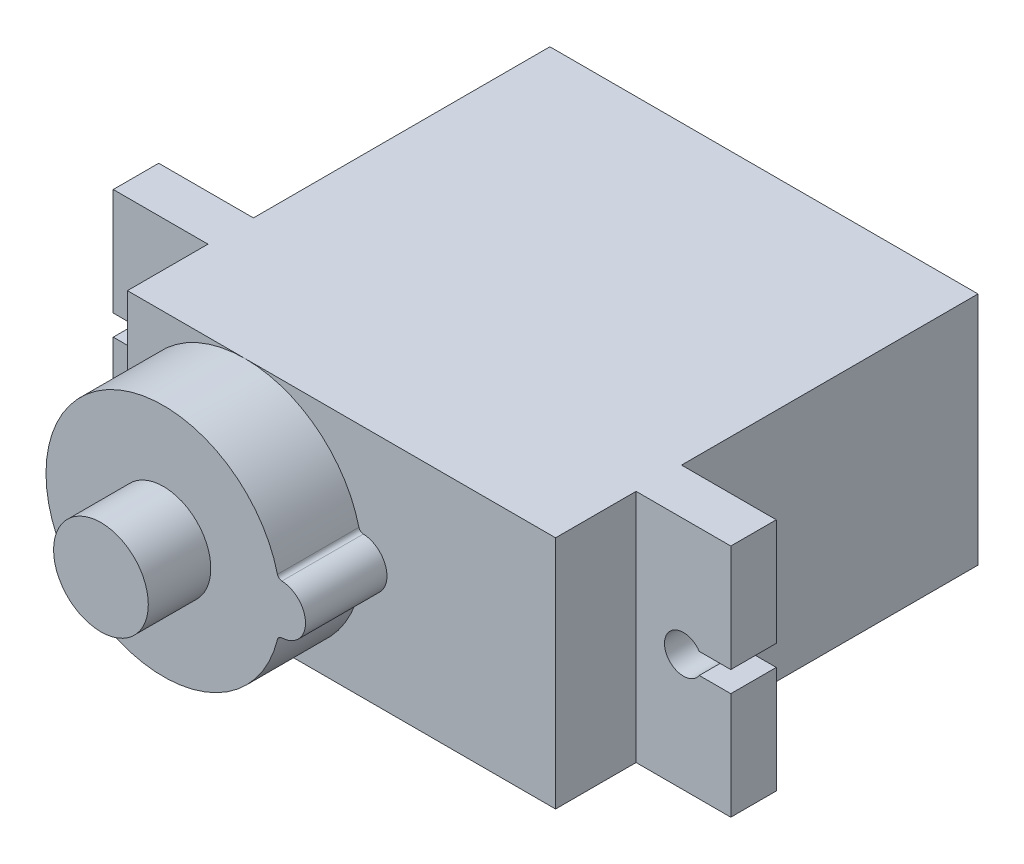
ISO-10303-21;
HEADER;
FILE_DESCRIPTION(('STEP AP214'),'2;1');
FILE_NAME('part.step','',(''),(''),'','','');
FILE_SCHEMA(('AUTOMOTIVE_DESIGN { 1 0 10303 214 1 1 1 1 }'));
ENDSEC;
DATA;
#1=APPLICATION_CONTEXT('core data for automotive mechanical design processes');
#2=APPLICATION_PROTOCOL_DEFINITION('international standard','automotive_design',2000,#1);
#3=PRODUCT_CONTEXT('',#1,'mechanical');
#4=PRODUCT('Part','Part','',(#3));
#5=PRODUCT_RELATED_PRODUCT_CATEGORY('part','',(#4));
#6=PRODUCT_DEFINITION_FORMATION('','',#4);
#7=PRODUCT_DEFINITION_CONTEXT('part definition',#1,'design');
#8=PRODUCT_DEFINITION('design','',#6,#7);
#9=PRODUCT_DEFINITION_SHAPE('','',#8);
#10=(LENGTH_UNIT() NAMED_UNIT(*) SI_UNIT(.MILLI.,.METRE.));
#11=(NAMED_UNIT(*) PLANE_ANGLE_UNIT() SI_UNIT($,.RADIAN.));
#12=(NAMED_UNIT(*) SI_UNIT($,.STERADIAN.) SOLID_ANGLE_UNIT());
#13=UNCERTAINTY_MEASURE_WITH_UNIT(LENGTH_MEASURE(1.E-05),#10,'distance_accuracy_value','');
#14=(GEOMETRIC_REPRESENTATION_CONTEXT(3) GLOBAL_UNCERTAINTY_ASSIGNED_CONTEXT((#13)) GLOBAL_UNIT_ASSIGNED_CONTEXT((#10,
#11,#12)) REPRESENTATION_CONTEXT('',''));
#15=CARTESIAN_POINT('',(0.,0.,0.));
#16=DIRECTION('',(0.,0.,1.));
#17=DIRECTION('',(1.,0.,0.));
#18=AXIS2_PLACEMENT_3D('',#15,#16,#17);
#19=CARTESIAN_POINT('',(-14.6,-1.2,4.5));
#20=DIRECTION('',(1.,0.,0.));
#21=DIRECTION('',(0.,1.,0.));
#22=AXIS2_PLACEMENT_3D('',#19,#20,#21);
#23=CYLINDRICAL_SURFACE('',#22,0.6);
#24=CARTESIAN_POINT('',(-14.6,-1.2,4.5));
#25=DIRECTION('',(-1.,0.,0.));
#26=DIRECTION('',(0.,-1.,0.));
#27=AXIS2_PLACEMENT_3D('',#24,#25,#26);
#28=CIRCLE('',#27,0.6);
#29=CARTESIAN_POINT('',(-14.6,-1.8,4.5));
#30=VERTEX_POINT('',#29);
#31=EDGE_CURVE('E12',#30,#30,#28,.T.);
#32=ORIENTED_EDGE('',*,*,#31,.F.);
#33=EDGE_LOOP('',(#32));
#34=FACE_BOUND('',#33,.T.);
#35=CARTESIAN_POINT('',(-11.3,-1.2,4.5));
#36=DIRECTION('',(-1.,0.,0.));
#37=DIRECTION('',(0.,-1.,0.));
#38=AXIS2_PLACEMENT_3D('',#35,#36,#37);
#39=CIRCLE('',#38,0.6);
#40=CARTESIAN_POINT('',(-11.3,-1.8,4.5));
#41=VERTEX_POINT('',#40);
#42=EDGE_CURVE('E68',#41,#41,#39,.T.);
#43=ORIENTED_EDGE('',*,*,#42,.T.);
#44=EDGE_LOOP('',(#43));
#45=FACE_BOUND('',#44,.T.);
#46=ADVANCED_FACE('F65',(#34,#45),#23,.T.);
#47=CARTESIAN_POINT('',(-14.6,0.,0.));
#48=DIRECTION('',(-1.,0.,0.));
#49=DIRECTION('',(0.,-1.,0.));
#50=AXIS2_PLACEMENT_3D('',#47,#48,#49);
#51=PLANE('',#50);
#52=ORIENTED_EDGE('',*,*,#31,.T.);
#53=EDGE_LOOP('',(#52));
#54=FACE_BOUND('',#53,.T.);
#55=ADVANCED_FACE('F80',(#54),#51,.T.);
#56=CARTESIAN_POINT('',(-11.3,0.,0.));
#57=DIRECTION('',(-1.,0.,0.));
#58=DIRECTION('',(0.,-1.,0.));
#59=AXIS2_PLACEMENT_3D('',#56,#57,#58);
#60=PLANE('',#59);
#61=ORIENTED_EDGE('',*,*,#42,.F.);
#62=EDGE_LOOP('',(#61));
#63=FACE_BOUND('',#62,.T.);
#64=ADVANCED_FACE('F78',(#63),#60,.F.);
#65=CLOSED_SHELL('',(#46,#55,#64));
#66=MANIFOLD_SOLID_BREP('B2',#65);
#67=CARTESIAN_POINT('',(-14.6,0.,4.5));
#68=DIRECTION('',(1.,0.,0.));
#69=DIRECTION('',(0.,1.,0.));
#70=AXIS2_PLACEMENT_3D('',#67,#68,#69);
#71=CYLINDRICAL_SURFACE('',#70,0.6);
#72=CARTESIAN_POINT('',(-14.6,0.,4.5));
#73=DIRECTION('',(-1.,0.,0.));
#74=DIRECTION('',(0.,-1.,0.));
#75=AXIS2_PLACEMENT_3D('',#72,#73,#74);
#76=CIRCLE('',#75,0.6);
#77=CARTESIAN_POINT('',(-14.6,-0.600000000000002,4.5));
#78=VERTEX_POINT('',#77);
#79=EDGE_CURVE('E64',#78,#78,#76,.T.);
#80=ORIENTED_EDGE('',*,*,#79,.F.);
#81=EDGE_LOOP('',(#80));
#82=FACE_BOUND('',#81,.T.);
#83=CARTESIAN_POINT('',(-11.3,0.,4.5));
#84=DIRECTION('',(-1.,0.,0.));
#85=DIRECTION('',(0.,-1.,0.));
#86=AXIS2_PLACEMENT_3D('',#83,#84,#85);
#87=CIRCLE('',#86,0.6);
#88=CARTESIAN_POINT('',(-11.3,-0.600000000000002,4.5));
#89=VERTEX_POINT('',#88);
#90=EDGE_CURVE('E126',#89,#89,#87,.T.);
#91=ORIENTED_EDGE('',*,*,#90,.T.);
#92=EDGE_LOOP('',(#91));
#93=FACE_BOUND('',#92,.T.);
#94=ADVANCED_FACE('F123',(#82,#93),#71,.T.);
#95=CARTESIAN_POINT('',(-14.6,0.,0.));
#96=DIRECTION('',(-1.,0.,0.));
#97=DIRECTION('',(0.,-1.,0.));
#98=AXIS2_PLACEMENT_3D('',#95,#96,#97);
#99=PLANE('',#98);
#100=ORIENTED_EDGE('',*,*,#79,.T.);
#101=EDGE_LOOP('',(#100));
#102=FACE_BOUND('',#101,.T.);
#103=ADVANCED_FACE('F138',(#102),#99,.T.);
#104=CARTESIAN_POINT('',(-11.3,0.,0.));
#105=DIRECTION('',(-1.,0.,0.));
#106=DIRECTION('',(0.,-1.,0.));
#107=AXIS2_PLACEMENT_3D('',#104,#105,#106);
#108=PLANE('',#107);
#109=ORIENTED_EDGE('',*,*,#90,.F.);
#110=EDGE_LOOP('',(#109));
#111=FACE_BOUND('',#110,.T.);
#112=ADVANCED_FACE('F136',(#111),#108,.F.);
#113=CLOSED_SHELL('',(#94,#103,#112));
#114=MANIFOLD_SOLID_BREP('B7',#113);
#115=CARTESIAN_POINT('',(-14.6,1.2,4.5));
#116=DIRECTION('',(1.,0.,0.));
#117=DIRECTION('',(0.,1.,0.));
#118=AXIS2_PLACEMENT_3D('',#115,#116,#117);
#119=CYLINDRICAL_SURFACE('',#118,0.6);
#120=CARTESIAN_POINT('',(-14.6,1.2,4.5));
#121=DIRECTION('',(-1.,0.,0.));
#122=DIRECTION('',(0.,-1.,0.));
#123=AXIS2_PLACEMENT_3D('',#120,#121,#122);
#124=CIRCLE('',#123,0.6);
#125=CARTESIAN_POINT('',(-14.6,0.599999999999998,4.5));
#126=VERTEX_POINT('',#125);
#127=EDGE_CURVE('E122',#126,#126,#124,.T.);
#128=ORIENTED_EDGE('',*,*,#127,.F.);
#129=EDGE_LOOP('',(#128));
#130=FACE_BOUND('',#129,.T.);
#131=CARTESIAN_POINT('',(-11.3,1.2,4.5));
#132=DIRECTION('',(-1.,0.,0.));
#133=DIRECTION('',(0.,-1.,0.));
#134=AXIS2_PLACEMENT_3D('',#131,#132,#133);
#135=CIRCLE('',#134,0.6);
#136=CARTESIAN_POINT('',(-11.3,0.599999999999998,4.5));
#137=VERTEX_POINT('',#136);
#138=EDGE_CURVE('E185',#137,#137,#135,.T.);
#139=ORIENTED_EDGE('',*,*,#138,.T.);
#140=EDGE_LOOP('',(#139));
#141=FACE_BOUND('',#140,.T.);
#142=ADVANCED_FACE('F182',(#130,#141),#119,.T.);
#143=CARTESIAN_POINT('',(-14.6,0.,0.));
#144=DIRECTION('',(-1.,0.,0.));
#145=DIRECTION('',(0.,-1.,0.));
#146=AXIS2_PLACEMENT_3D('',#143,#144,#145);
#147=PLANE('',#146);
#148=ORIENTED_EDGE('',*,*,#127,.T.);
#149=EDGE_LOOP('',(#148));
#150=FACE_BOUND('',#149,.T.);
#151=ADVANCED_FACE('F197',(#150),#147,.T.);
#152=CARTESIAN_POINT('',(-11.3,0.,0.));
#153=DIRECTION('',(-1.,0.,0.));
#154=DIRECTION('',(0.,-1.,0.));
#155=AXIS2_PLACEMENT_3D('',#152,#153,#154);
#156=PLANE('',#155);
#157=ORIENTED_EDGE('',*,*,#138,.F.);
#158=EDGE_LOOP('',(#157));
#159=FACE_BOUND('',#158,.T.);
#160=ADVANCED_FACE('F195',(#159),#156,.F.);
#161=CLOSED_SHELL('',(#142,#151,#160));
#162=MANIFOLD_SOLID_BREP('B59',#161);
#163=CARTESIAN_POINT('',(0.,0.,22.3));
#164=DIRECTION('',(0.,0.,1.));
#165=DIRECTION('',(1.,0.,0.));
#166=AXIS2_PLACEMENT_3D('',#163,#164,#165);
#167=PLANE('',#166);
#168=CARTESIAN_POINT('',(-5.1,0.,22.3));
#169=DIRECTION('',(0.,0.,1.));
#170=DIRECTION('',(1.,0.,0.));
#171=AXIS2_PLACEMENT_3D('',#168,#169,#170);
#172=CIRCLE('',#171,6.2);
#173=CARTESIAN_POINT('',(-5.1,6.2,22.3));
#174=VERTEX_POINT('',#173);
#175=CARTESIAN_POINT('',(-11.3,0.,22.3));
#176=VERTEX_POINT('',#175);
#177=EDGE_CURVE('E243',#174,#176,#172,.T.);
#178=ORIENTED_EDGE('',*,*,#177,.F.);
#179=DIRECTION('',(-1.,0.,0.));
#180=VECTOR('',#179,1.);
#181=CARTESIAN_POINT('',(-11.3,6.2,22.3));
#182=LINE('',#181,#180);
#183=CARTESIAN_POINT('',(-11.3,6.2,22.3));
#184=VERTEX_POINT('',#183);
#185=EDGE_CURVE('E568',#174,#184,#182,.T.);
#186=ORIENTED_EDGE('',*,*,#185,.T.);
#187=DIRECTION('',(0.,-1.,0.));
#188=VECTOR('',#187,1.);
#189=CARTESIAN_POINT('',(-11.3,6.2,22.3));
#190=LINE('',#189,#188);
#191=EDGE_CURVE('E574',#184,#176,#190,.T.);
#192=ORIENTED_EDGE('',*,*,#191,.T.);
#193=EDGE_LOOP('',(#178,#186,#192));
#194=FACE_BOUND('',#193,.T.);
#195=ADVANCED_FACE('F234',(#194),#167,.T.);
#196=CARTESIAN_POINT('',(-5.1,-6.2,22.3));
#197=VERTEX_POINT('',#196);
#198=EDGE_CURVE('E639',#176,#197,#172,.T.);
#199=ORIENTED_EDGE('',*,*,#198,.F.);
#200=CARTESIAN_POINT('',(-11.3,-6.2,22.3));
#201=VERTEX_POINT('',#200);
#202=EDGE_CURVE('E573',#176,#201,#190,.T.);
#203=ORIENTED_EDGE('',*,*,#202,.T.);
#204=DIRECTION('',(1.,0.,0.));
#205=VECTOR('',#204,1.);
#206=CARTESIAN_POINT('',(-11.3,-6.2,22.3));
#207=LINE('',#206,#205);
#208=EDGE_CURVE('E579',#201,#197,#207,.T.);
#209=ORIENTED_EDGE('',*,*,#208,.T.);
#210=EDGE_LOOP('',(#199,#203,#209));
#211=FACE_BOUND('',#210,.T.);
#212=ADVANCED_FACE('F721',(#211),#167,.T.);
#213=CARTESIAN_POINT('',(16.3,6.2,18.05));
#214=DIRECTION('',(1.,0.,0.));
#215=DIRECTION('',(0.,0.,-1.));
#216=AXIS2_PLACEMENT_3D('',#213,#214,#215);
#217=PLANE('',#216);
#218=DIRECTION('',(0.,0.,1.));
#219=VECTOR('',#218,1.);
#220=CARTESIAN_POINT('',(16.3,0.55,-4.25));
#221=LINE('',#220,#219);
#222=CARTESIAN_POINT('',(16.3,0.55,15.65));
#223=VERTEX_POINT('',#222);
#224=CARTESIAN_POINT('',(16.3,0.55,18.05));
#225=VERTEX_POINT('',#224);
#226=EDGE_CURVE('E457',#223,#225,#221,.T.);
#227=ORIENTED_EDGE('',*,*,#226,.F.);
#228=DIRECTION('',(0.,-1.,0.));
#229=VECTOR('',#228,1.);
#230=CARTESIAN_POINT('',(16.3,6.2,15.65));
#231=LINE('',#230,#229);
#232=CARTESIAN_POINT('',(16.3,6.2,15.65));
#233=VERTEX_POINT('',#232);
#234=EDGE_CURVE('E556',#233,#223,#231,.T.);
#235=ORIENTED_EDGE('',*,*,#234,.F.);
#236=DIRECTION('',(0.,0.,1.));
#237=VECTOR('',#236,1.);
#238=CARTESIAN_POINT('',(16.3,6.2,18.05));
#239=LINE('',#238,#237);
#240=CARTESIAN_POINT('',(16.3,6.2,18.05));
#241=VERTEX_POINT('',#240);
#242=EDGE_CURVE('E528',#233,#241,#239,.T.);
#243=ORIENTED_EDGE('',*,*,#242,.T.);
#244=DIRECTION('',(0.,-1.,0.));
#245=VECTOR('',#244,1.);
#246=CARTESIAN_POINT('',(16.3,6.2,18.05));
#247=LINE('',#246,#245);
#248=EDGE_CURVE('E551',#241,#225,#247,.T.);
#249=ORIENTED_EDGE('',*,*,#248,.T.);
#250=EDGE_LOOP('',(#227,#235,#243,#249));
#251=FACE_BOUND('',#250,.T.);
#252=ADVANCED_FACE('F679',(#251),#217,.T.);
#253=CARTESIAN_POINT('',(-16.3,6.2,18.05));
#254=DIRECTION('',(-1.,0.,0.));
#255=DIRECTION('',(0.,0.,1.));
#256=AXIS2_PLACEMENT_3D('',#253,#254,#255);
#257=PLANE('',#256);
#258=DIRECTION('',(0.,0.,1.));
#259=VECTOR('',#258,1.);
#260=CARTESIAN_POINT('',(-16.3,-0.550000000000009,18.05));
#261=LINE('',#260,#259);
#262=CARTESIAN_POINT('',(-16.3,-0.550000000000009,15.65));
#263=VERTEX_POINT('',#262);
#264=CARTESIAN_POINT('',(-16.3,-0.550000000000009,18.05));
#265=VERTEX_POINT('',#264);
#266=EDGE_CURVE('E620',#263,#265,#261,.T.);
#267=ORIENTED_EDGE('',*,*,#266,.F.);
#268=DIRECTION('',(0.,-1.,0.));
#269=VECTOR('',#268,1.);
#270=CARTESIAN_POINT('',(-16.3,6.2,15.65));
#271=LINE('',#270,#269);
#272=CARTESIAN_POINT('',(-16.3,-6.2,15.65));
#273=VERTEX_POINT('',#272);
#274=EDGE_CURVE('E494',#263,#273,#271,.T.);
#275=ORIENTED_EDGE('',*,*,#274,.T.);
#276=DIRECTION('',(0.,0.,-1.));
#277=VECTOR('',#276,1.);
#278=CARTESIAN_POINT('',(-16.3,-6.2,18.05));
#279=LINE('',#278,#277);
#280=CARTESIAN_POINT('',(-16.3,-6.2,18.05));
#281=VERTEX_POINT('',#280);
#282=EDGE_CURVE('E505',#281,#273,#279,.T.);
#283=ORIENTED_EDGE('',*,*,#282,.F.);
#284=DIRECTION('',(0.,-1.,0.));
#285=VECTOR('',#284,1.);
#286=CARTESIAN_POINT('',(-16.3,6.2,18.05));
#287=LINE('',#286,#285);
#288=EDGE_CURVE('E489',#265,#281,#287,.T.);
#289=ORIENTED_EDGE('',*,*,#288,.F.);
#290=EDGE_LOOP('',(#267,#275,#283,#289));
#291=FACE_BOUND('',#290,.T.);
#292=ADVANCED_FACE('F703',(#291),#257,.T.);
#293=CARTESIAN_POINT('',(-11.3,6.2,22.3));
#294=DIRECTION('',(1.,0.,0.));
#295=DIRECTION('',(0.,1.,0.));
#296=AXIS2_PLACEMENT_3D('',#293,#294,#295);
#297=PLANE('',#296);
#298=DIRECTION('',(0.,-1.,0.));
#299=VECTOR('',#298,1.);
#300=CARTESIAN_POINT('',(-11.3,6.2,15.65));
#301=LINE('',#300,#299);
#302=CARTESIAN_POINT('',(-11.3,6.2,15.65));
#303=VERTEX_POINT('',#302);
#304=CARTESIAN_POINT('',(-11.3,-6.2,15.65));
#305=VERTEX_POINT('',#304);
#306=EDGE_CURVE('E495',#303,#305,#301,.T.);
#307=ORIENTED_EDGE('',*,*,#306,.F.);
#308=DIRECTION('',(0.,0.,-1.));
#309=VECTOR('',#308,1.);
#310=CARTESIAN_POINT('',(-11.3,6.2,22.3));
#311=LINE('',#310,#309);
#312=CARTESIAN_POINT('',(-11.3,6.2,0.));
#313=VERTEX_POINT('',#312);
#314=EDGE_CURVE('E607',#303,#313,#311,.T.);
#315=ORIENTED_EDGE('',*,*,#314,.T.);
#316=DIRECTION('',(0.,-1.,0.));
#317=VECTOR('',#316,1.);
#318=CARTESIAN_POINT('',(-11.3,6.2,0.));
#319=LINE('',#318,#317);
#320=CARTESIAN_POINT('',(-11.3,-6.2,0.));
#321=VERTEX_POINT('',#320);
#322=EDGE_CURVE('E591',#313,#321,#319,.T.);
#323=ORIENTED_EDGE('',*,*,#322,.T.);
#324=DIRECTION('',(0.,0.,-1.));
#325=VECTOR('',#324,1.);
#326=CARTESIAN_POINT('',(-11.3,-6.2,22.3));
#327=LINE('',#326,#325);
#328=EDGE_CURVE('E602',#305,#321,#327,.T.);
#329=ORIENTED_EDGE('',*,*,#328,.F.);
#330=EDGE_LOOP('',(#307,#315,#323,#329));
#331=FACE_BOUND('',#330,.T.);
#332=ADVANCED_FACE('F764',(#331),#297,.F.);
#333=CARTESIAN_POINT('',(11.3,6.2,22.3));
#334=DIRECTION('',(-1.,0.,0.));
#335=DIRECTION('',(0.,-1.,0.));
#336=AXIS2_PLACEMENT_3D('',#333,#334,#335);
#337=PLANE('',#336);
#338=DIRECTION('',(0.,-1.,0.));
#339=VECTOR('',#338,1.);
#340=CARTESIAN_POINT('',(11.3,6.2,18.05));
#341=LINE('',#340,#339);
#342=CARTESIAN_POINT('',(11.3,6.2,18.05));
#343=VERTEX_POINT('',#342);
#344=CARTESIAN_POINT('',(11.3,-6.2,18.05));
#345=VERTEX_POINT('',#344);
#346=EDGE_CURVE('E547',#343,#345,#341,.T.);
#347=ORIENTED_EDGE('',*,*,#346,.F.);
#348=DIRECTION('',(0.,0.,-1.));
#349=VECTOR('',#348,1.);
#350=CARTESIAN_POINT('',(11.3,6.2,22.3));
#351=LINE('',#350,#349);
#352=CARTESIAN_POINT('',(11.3,6.2,22.3));
#353=VERTEX_POINT('',#352);
#354=EDGE_CURVE('E613',#353,#343,#351,.T.);
#355=ORIENTED_EDGE('',*,*,#354,.F.);
#356=DIRECTION('',(0.,1.,0.));
#357=VECTOR('',#356,1.);
#358=CARTESIAN_POINT('',(11.3,6.2,22.3));
#359=LINE('',#358,#357);
#360=CARTESIAN_POINT('',(11.3,-6.2,22.3));
#361=VERTEX_POINT('',#360);
#362=EDGE_CURVE('E564',#361,#353,#359,.T.);
#363=ORIENTED_EDGE('',*,*,#362,.F.);
#364=DIRECTION('',(0.,0.,-1.));
#365=VECTOR('',#364,1.);
#366=CARTESIAN_POINT('',(11.3,-6.2,22.3));
#367=LINE('',#366,#365);
#368=EDGE_CURVE('E598',#361,#345,#367,.T.);
#369=ORIENTED_EDGE('',*,*,#368,.T.);
#370=EDGE_LOOP('',(#347,#355,#363,#369));
#371=FACE_BOUND('',#370,.T.);
#372=ADVANCED_FACE('F669',(#371),#337,.F.);
#373=CARTESIAN_POINT('',(11.3,6.2,15.65));
#374=VERTEX_POINT('',#373);
#375=CARTESIAN_POINT('',(11.3,6.2,0.));
#376=VERTEX_POINT('',#375);
#377=EDGE_CURVE('E612',#374,#376,#351,.T.);
#378=ORIENTED_EDGE('',*,*,#377,.F.);
#379=DIRECTION('',(0.,-1.,0.));
#380=VECTOR('',#379,1.);
#381=CARTESIAN_POINT('',(11.3,6.2,15.65));
#382=LINE('',#381,#380);
#383=CARTESIAN_POINT('',(11.3,-6.2,15.65));
#384=VERTEX_POINT('',#383);
#385=EDGE_CURVE('E536',#374,#384,#382,.T.);
#386=ORIENTED_EDGE('',*,*,#385,.T.);
#387=CARTESIAN_POINT('',(11.3,-6.2,0.));
#388=VERTEX_POINT('',#387);
#389=EDGE_CURVE('E583',#384,#388,#367,.T.);
#390=ORIENTED_EDGE('',*,*,#389,.T.);
#391=DIRECTION('',(0.,1.,0.));
#392=VECTOR('',#391,1.);
#393=CARTESIAN_POINT('',(11.3,6.2,0.));
#394=LINE('',#393,#392);
#395=EDGE_CURVE('E550',#388,#376,#394,.T.);
#396=ORIENTED_EDGE('',*,*,#395,.T.);
#397=EDGE_LOOP('',(#378,#386,#390,#396));
#398=FACE_BOUND('',#397,.T.);
#399=ADVANCED_FACE('F236',(#398),#337,.F.);
#400=CARTESIAN_POINT('',(-11.3,6.2,22.3));
#401=DIRECTION('',(0.,-1.,0.));
#402=DIRECTION('',(0.,0.,-1.));
#403=AXIS2_PLACEMENT_3D('',#400,#401,#402);
#404=PLANE('',#403);
#405=DIRECTION('',(-1.,0.,0.));
#406=VECTOR('',#405,1.);
#407=CARTESIAN_POINT('',(-11.3,6.2,0.));
#408=LINE('',#407,#406);
#409=EDGE_CURVE('E587',#376,#313,#408,.T.);
#410=ORIENTED_EDGE('',*,*,#409,.T.);
#411=ORIENTED_EDGE('',*,*,#314,.F.);
#412=DIRECTION('',(1.,0.,0.));
#413=VECTOR('',#412,1.);
#414=CARTESIAN_POINT('',(-11.3,6.2,15.65));
#415=LINE('',#414,#413);
#416=CARTESIAN_POINT('',(-16.3,6.2,15.65));
#417=VERTEX_POINT('',#416);
#418=EDGE_CURVE('E488',#417,#303,#415,.T.);
#419=ORIENTED_EDGE('',*,*,#418,.F.);
#420=DIRECTION('',(0.,0.,-1.));
#421=VECTOR('',#420,1.);
#422=CARTESIAN_POINT('',(-16.3,6.2,18.05));
#423=LINE('',#422,#421);
#424=CARTESIAN_POINT('',(-16.3,6.2,18.05));
#425=VERTEX_POINT('',#424);
#426=EDGE_CURVE('E517',#425,#417,#423,.T.);
#427=ORIENTED_EDGE('',*,*,#426,.F.);
#428=DIRECTION('',(-1.,0.,0.));
#429=VECTOR('',#428,1.);
#430=CARTESIAN_POINT('',(-11.3,6.2,18.05));
#431=LINE('',#430,#429);
#432=CARTESIAN_POINT('',(-11.3,6.2,18.05));
#433=VERTEX_POINT('',#432);
#434=EDGE_CURVE('E506',#433,#425,#431,.T.);
#435=ORIENTED_EDGE('',*,*,#434,.F.);
#436=EDGE_CURVE('E608',#184,#433,#311,.T.);
#437=ORIENTED_EDGE('',*,*,#436,.F.);
#438=ORIENTED_EDGE('',*,*,#185,.F.);
#439=EDGE_CURVE('E570',#353,#174,#182,.T.);
#440=ORIENTED_EDGE('',*,*,#439,.F.);
#441=ORIENTED_EDGE('',*,*,#354,.T.);
#442=DIRECTION('',(-1.,0.,0.));
#443=VECTOR('',#442,1.);
#444=CARTESIAN_POINT('',(11.3,6.2,18.05));
#445=LINE('',#444,#443);
#446=EDGE_CURVE('E533',#241,#343,#445,.T.);
#447=ORIENTED_EDGE('',*,*,#446,.F.);
#448=ORIENTED_EDGE('',*,*,#242,.F.);
#449=DIRECTION('',(1.,0.,0.));
#450=VECTOR('',#449,1.);
#451=CARTESIAN_POINT('',(11.3,6.2,15.65));
#452=LINE('',#451,#450);
#453=EDGE_CURVE('E524',#374,#233,#452,.T.);
#454=ORIENTED_EDGE('',*,*,#453,.F.);
#455=ORIENTED_EDGE('',*,*,#377,.T.);
#456=EDGE_LOOP('',(#410,#411,#419,#427,#435,#437,#438,#440,#441,#447,#448,#454,#455));
#457=FACE_BOUND('',#456,.T.);
#458=ADVANCED_FACE('F659',(#457),#404,.F.);
#459=ORIENTED_EDGE('',*,*,#436,.T.);
#460=DIRECTION('',(0.,-1.,0.));
#461=VECTOR('',#460,1.);
#462=CARTESIAN_POINT('',(-11.3,6.2,18.05));
#463=LINE('',#462,#461);
#464=CARTESIAN_POINT('',(-11.3,-6.2,18.05));
#465=VERTEX_POINT('',#464);
#466=EDGE_CURVE('E483',#433,#465,#463,.T.);
#467=ORIENTED_EDGE('',*,*,#466,.T.);
#468=EDGE_CURVE('E603',#201,#465,#327,.T.);
#469=ORIENTED_EDGE('',*,*,#468,.F.);
#470=ORIENTED_EDGE('',*,*,#202,.F.);
#471=ORIENTED_EDGE('',*,*,#191,.F.);
#472=EDGE_LOOP('',(#459,#467,#469,#470,#471));
#473=FACE_BOUND('',#472,.T.);
#474=ADVANCED_FACE('F718',(#473),#297,.F.);
#475=CARTESIAN_POINT('',(-11.3,-6.2,22.3));
#476=DIRECTION('',(0.,1.,0.));
#477=DIRECTION('',(0.,0.,1.));
#478=AXIS2_PLACEMENT_3D('',#475,#476,#477);
#479=PLANE('',#478);
#480=DIRECTION('',(1.,0.,0.));
#481=VECTOR('',#480,1.);
#482=CARTESIAN_POINT('',(-11.3,-6.2,0.));
#483=LINE('',#482,#481);
#484=EDGE_CURVE('E569',#321,#388,#483,.T.);
#485=ORIENTED_EDGE('',*,*,#484,.T.);
#486=ORIENTED_EDGE('',*,*,#389,.F.);
#487=DIRECTION('',(1.,0.,0.));
#488=VECTOR('',#487,1.);
#489=CARTESIAN_POINT('',(11.3,-6.2,15.65));
#490=LINE('',#489,#488);
#491=CARTESIAN_POINT('',(16.3,-6.2,15.65));
#492=VERTEX_POINT('',#491);
#493=EDGE_CURVE('E514',#384,#492,#490,.T.);
#494=ORIENTED_EDGE('',*,*,#493,.T.);
#495=DIRECTION('',(0.,0.,1.));
#496=VECTOR('',#495,1.);
#497=CARTESIAN_POINT('',(16.3,-6.2,18.05));
#498=LINE('',#497,#496);
#499=CARTESIAN_POINT('',(16.3,-6.2,18.05));
#500=VERTEX_POINT('',#499);
#501=EDGE_CURVE('E540',#492,#500,#498,.T.);
#502=ORIENTED_EDGE('',*,*,#501,.T.);
#503=DIRECTION('',(-1.,0.,0.));
#504=VECTOR('',#503,1.);
#505=CARTESIAN_POINT('',(11.3,-6.2,18.05));
#506=LINE('',#505,#504);
#507=EDGE_CURVE('E529',#500,#345,#506,.T.);
#508=ORIENTED_EDGE('',*,*,#507,.T.);
#509=ORIENTED_EDGE('',*,*,#368,.F.);
#510=EDGE_CURVE('E578',#197,#361,#207,.T.);
#511=ORIENTED_EDGE('',*,*,#510,.F.);
#512=ORIENTED_EDGE('',*,*,#208,.F.);
#513=ORIENTED_EDGE('',*,*,#468,.T.);
#514=DIRECTION('',(-1.,0.,0.));
#515=VECTOR('',#514,1.);
#516=CARTESIAN_POINT('',(-11.3,-6.2,18.05));
#517=LINE('',#516,#515);
#518=EDGE_CURVE('E510',#465,#281,#517,.T.);
#519=ORIENTED_EDGE('',*,*,#518,.T.);
#520=ORIENTED_EDGE('',*,*,#282,.T.);
#521=DIRECTION('',(1.,0.,0.));
#522=VECTOR('',#521,1.);
#523=CARTESIAN_POINT('',(-11.3,-6.2,15.65));
#524=LINE('',#523,#522);
#525=EDGE_CURVE('E501',#273,#305,#524,.T.);
#526=ORIENTED_EDGE('',*,*,#525,.T.);
#527=ORIENTED_EDGE('',*,*,#328,.T.);
#528=EDGE_LOOP('',(#485,#486,#494,#502,#508,#509,#511,#512,#513,#519,#520,#526,#527));
#529=FACE_BOUND('',#528,.T.);
#530=ADVANCED_FACE('F711',(#529),#479,.F.);
#531=CARTESIAN_POINT('',(0.918604651162794,-1.48875721761529,22.3));
#532=VERTEX_POINT('',#531);
#533=EDGE_CURVE('E633',#197,#532,#172,.T.);
#534=ORIENTED_EDGE('',*,*,#533,.F.);
#535=ORIENTED_EDGE('',*,*,#510,.T.);
#536=ORIENTED_EDGE('',*,*,#362,.T.);
#537=ORIENTED_EDGE('',*,*,#439,.T.);
#538=CARTESIAN_POINT('',(0.918604651162794,1.48875721761529,22.3));
#539=VERTEX_POINT('',#538);
#540=EDGE_CURVE('E257',#539,#174,#172,.T.);
#541=ORIENTED_EDGE('',*,*,#540,.F.);
#542=CARTESIAN_POINT('',(1.16129032258065,1.54878775058365,22.3));
#543=DIRECTION('',(0.,0.,-1.));
#544=DIRECTION('',(-1.,0.,0.));
#545=AXIS2_PLACEMENT_3D('',#542,#543,#544);
#546=CIRCLE('',#545,0.25);
#547=CARTESIAN_POINT('',(1.15140478668054,1.29898327468306,22.3));
#548=VERTEX_POINT('',#547);
#549=EDGE_CURVE('E647',#548,#539,#546,.T.);
#550=ORIENTED_EDGE('',*,*,#549,.F.);
#551=CARTESIAN_POINT('',(1.1,0.,22.3));
#552=DIRECTION('',(0.,0.,1.));
#553=DIRECTION('',(1.,0.,0.));
#554=AXIS2_PLACEMENT_3D('',#551,#552,#553);
#555=CIRCLE('',#554,1.3);
#556=CARTESIAN_POINT('',(1.15140478668054,-1.29898327468306,22.3));
#557=VERTEX_POINT('',#556);
#558=EDGE_CURVE('E651',#557,#548,#555,.T.);
#559=ORIENTED_EDGE('',*,*,#558,.F.);
#560=CARTESIAN_POINT('',(1.16129032258065,-1.54878775058365,22.3));
#561=DIRECTION('',(0.,0.,-1.));
#562=DIRECTION('',(-1.,0.,0.));
#563=AXIS2_PLACEMENT_3D('',#560,#561,#562);
#564=CIRCLE('',#563,0.25);
#565=EDGE_CURVE('E250',#532,#557,#564,.T.);
#566=ORIENTED_EDGE('',*,*,#565,.F.);
#567=EDGE_LOOP('',(#534,#535,#536,#537,#541,#550,#559,#566));
#568=FACE_BOUND('',#567,.T.);
#569=ADVANCED_FACE('F662',(#568),#167,.T.);
#570=CARTESIAN_POINT('',(0.,0.,0.));
#571=DIRECTION('',(0.,0.,1.));
#572=DIRECTION('',(1.,0.,0.));
#573=AXIS2_PLACEMENT_3D('',#570,#571,#572);
#574=PLANE('',#573);
#575=ORIENTED_EDGE('',*,*,#395,.F.);
#576=ORIENTED_EDGE('',*,*,#484,.F.);
#577=ORIENTED_EDGE('',*,*,#322,.F.);
#578=ORIENTED_EDGE('',*,*,#409,.F.);
#579=EDGE_LOOP('',(#575,#576,#577,#578));
#580=FACE_BOUND('',#579,.T.);
#581=ADVANCED_FACE('F753',(#580),#574,.F.);
#582=CARTESIAN_POINT('',(11.3,6.2,18.05));
#583=DIRECTION('',(0.,0.,1.));
#584=DIRECTION('',(1.,0.,0.));
#585=AXIS2_PLACEMENT_3D('',#582,#583,#584);
#586=PLANE('',#585);
#587=DIRECTION('',(-1.,0.,0.));
#588=VECTOR('',#587,1.);
#589=CARTESIAN_POINT('',(14.6351646544245,0.55,18.05));
#590=LINE('',#589,#588);
#591=CARTESIAN_POINT('',(14.6351646544245,0.55,18.05));
#592=VERTEX_POINT('',#591);
#593=EDGE_CURVE('E448',#225,#592,#590,.T.);
#594=ORIENTED_EDGE('',*,*,#593,.F.);
#595=ORIENTED_EDGE('',*,*,#248,.F.);
#596=ORIENTED_EDGE('',*,*,#446,.T.);
#597=ORIENTED_EDGE('',*,*,#346,.T.);
#598=ORIENTED_EDGE('',*,*,#507,.F.);
#599=CARTESIAN_POINT('',(16.3,-0.55,18.05));
#600=VERTEX_POINT('',#599);
#601=EDGE_CURVE('E555',#600,#500,#247,.T.);
#602=ORIENTED_EDGE('',*,*,#601,.F.);
#603=DIRECTION('',(1.,0.,0.));
#604=VECTOR('',#603,1.);
#605=CARTESIAN_POINT('',(16.3,-0.55,18.05));
#606=LINE('',#605,#604);
#607=CARTESIAN_POINT('',(14.6351646544245,-0.55,18.05));
#608=VERTEX_POINT('',#607);
#609=EDGE_CURVE('E444',#608,#600,#606,.T.);
#610=ORIENTED_EDGE('',*,*,#609,.F.);
#611=CARTESIAN_POINT('',(13.8,0.,18.05));
#612=DIRECTION('',(0.,0.,1.));
#613=DIRECTION('',(1.,0.,0.));
#614=AXIS2_PLACEMENT_3D('',#611,#612,#613);
#615=CIRCLE('',#614,1.);
#616=EDGE_CURVE('E440',#592,#608,#615,.T.);
#617=ORIENTED_EDGE('',*,*,#616,.F.);
#618=EDGE_LOOP('',(#594,#595,#596,#597,#598,#602,#610,#617));
#619=FACE_BOUND('',#618,.T.);
#620=ADVANCED_FACE('F675',(#619),#586,.T.);
#621=DIRECTION('',(0.,0.,1.));
#622=VECTOR('',#621,1.);
#623=CARTESIAN_POINT('',(16.3,-0.55,-4.25));
#624=LINE('',#623,#622);
#625=CARTESIAN_POINT('',(16.3,-0.549999999999998,15.65));
#626=VERTEX_POINT('',#625);
#627=EDGE_CURVE('E460',#626,#600,#624,.T.);
#628=ORIENTED_EDGE('',*,*,#627,.T.);
#629=ORIENTED_EDGE('',*,*,#601,.T.);
#630=ORIENTED_EDGE('',*,*,#501,.F.);
#631=EDGE_CURVE('E560',#626,#492,#231,.T.);
#632=ORIENTED_EDGE('',*,*,#631,.F.);
#633=EDGE_LOOP('',(#628,#629,#630,#632));
#634=FACE_BOUND('',#633,.T.);
#635=ADVANCED_FACE('F726',(#634),#217,.T.);
#636=CARTESIAN_POINT('',(11.3,6.2,15.65));
#637=DIRECTION('',(0.,0.,-1.));
#638=DIRECTION('',(-1.,0.,0.));
#639=AXIS2_PLACEMENT_3D('',#636,#637,#638);
#640=PLANE('',#639);
#641=DIRECTION('',(1.,0.,0.));
#642=VECTOR('',#641,1.);
#643=CARTESIAN_POINT('',(11.3,0.55,15.65));
#644=LINE('',#643,#642);
#645=CARTESIAN_POINT('',(14.6351646544245,0.55,15.65));
#646=VERTEX_POINT('',#645);
#647=EDGE_CURVE('E631',#646,#223,#644,.T.);
#648=ORIENTED_EDGE('',*,*,#647,.F.);
#649=CARTESIAN_POINT('',(13.8,0.,15.65));
#650=DIRECTION('',(0.,0.,-1.));
#651=DIRECTION('',(-1.,0.,0.));
#652=AXIS2_PLACEMENT_3D('',#649,#650,#651);
#653=CIRCLE('',#652,1.);
#654=CARTESIAN_POINT('',(14.6351646544245,-0.55,15.65));
#655=VERTEX_POINT('',#654);
#656=EDGE_CURVE('E629',#655,#646,#653,.T.);
#657=ORIENTED_EDGE('',*,*,#656,.F.);
#658=DIRECTION('',(-1.,0.,0.));
#659=VECTOR('',#658,1.);
#660=CARTESIAN_POINT('',(11.3,-0.55,15.65));
#661=LINE('',#660,#659);
#662=EDGE_CURVE('E626',#626,#655,#661,.T.);
#663=ORIENTED_EDGE('',*,*,#662,.F.);
#664=ORIENTED_EDGE('',*,*,#631,.T.);
#665=ORIENTED_EDGE('',*,*,#493,.F.);
#666=ORIENTED_EDGE('',*,*,#385,.F.);
#667=ORIENTED_EDGE('',*,*,#453,.T.);
#668=ORIENTED_EDGE('',*,*,#234,.T.);
#669=EDGE_LOOP('',(#648,#657,#663,#664,#665,#666,#667,#668));
#670=FACE_BOUND('',#669,.T.);
#671=ADVANCED_FACE('F681',(#670),#640,.T.);
#672=CARTESIAN_POINT('',(-11.3,6.2,18.05));
#673=DIRECTION('',(0.,0.,1.));
#674=DIRECTION('',(1.,0.,0.));
#675=AXIS2_PLACEMENT_3D('',#672,#673,#674);
#676=PLANE('',#675);
#677=DIRECTION('',(1.,0.,0.));
#678=VECTOR('',#677,1.);
#679=CARTESIAN_POINT('',(-16.3,-0.550000000000009,18.05));
#680=LINE('',#679,#678);
#681=CARTESIAN_POINT('',(-14.6351646544245,-0.550000000000007,18.05));
#682=VERTEX_POINT('',#681);
#683=EDGE_CURVE('E467',#265,#682,#680,.T.);
#684=ORIENTED_EDGE('',*,*,#683,.F.);
#685=ORIENTED_EDGE('',*,*,#288,.T.);
#686=ORIENTED_EDGE('',*,*,#518,.F.);
#687=ORIENTED_EDGE('',*,*,#466,.F.);
#688=ORIENTED_EDGE('',*,*,#434,.T.);
#689=CARTESIAN_POINT('',(-16.3,0.549999999999994,18.05));
#690=VERTEX_POINT('',#689);
#691=EDGE_CURVE('E484',#425,#690,#287,.T.);
#692=ORIENTED_EDGE('',*,*,#691,.T.);
#693=DIRECTION('',(-1.,0.,0.));
#694=VECTOR('',#693,1.);
#695=CARTESIAN_POINT('',(-14.6351646544245,0.549999999999993,18.05));
#696=LINE('',#695,#694);
#697=CARTESIAN_POINT('',(-14.6351646544245,0.549999999999993,18.05));
#698=VERTEX_POINT('',#697);
#699=EDGE_CURVE('E472',#698,#690,#696,.T.);
#700=ORIENTED_EDGE('',*,*,#699,.F.);
#701=CARTESIAN_POINT('',(-13.8,0.,18.05));
#702=DIRECTION('',(0.,0.,1.));
#703=DIRECTION('',(-1.,0.,0.));
#704=AXIS2_PLACEMENT_3D('',#701,#702,#703);
#705=CIRCLE('',#704,1.);
#706=EDGE_CURVE('E445',#682,#698,#705,.T.);
#707=ORIENTED_EDGE('',*,*,#706,.F.);
#708=EDGE_LOOP('',(#684,#685,#686,#687,#688,#692,#700,#707));
#709=FACE_BOUND('',#708,.T.);
#710=ADVANCED_FACE('F716',(#709),#676,.T.);
#711=CARTESIAN_POINT('',(-11.3,6.2,15.65));
#712=DIRECTION('',(0.,0.,-1.));
#713=DIRECTION('',(-1.,0.,0.));
#714=AXIS2_PLACEMENT_3D('',#711,#712,#713);
#715=PLANE('',#714);
#716=DIRECTION('',(-1.,0.,0.));
#717=VECTOR('',#716,1.);
#718=CARTESIAN_POINT('',(-11.3,-0.550000000000004,15.65));
#719=LINE('',#718,#717);
#720=CARTESIAN_POINT('',(-14.6351646544245,-0.550000000000007,15.65));
#721=VERTEX_POINT('',#720);
#722=EDGE_CURVE('E480',#721,#263,#719,.T.);
#723=ORIENTED_EDGE('',*,*,#722,.F.);
#724=CARTESIAN_POINT('',(-13.8,0.,15.65));
#725=DIRECTION('',(0.,0.,-1.));
#726=DIRECTION('',(-1.,0.,0.));
#727=AXIS2_PLACEMENT_3D('',#724,#725,#726);
#728=CIRCLE('',#727,1.);
#729=CARTESIAN_POINT('',(-14.6351646544245,0.549999999999993,15.65));
#730=VERTEX_POINT('',#729);
#731=EDGE_CURVE('E623',#730,#721,#728,.T.);
#732=ORIENTED_EDGE('',*,*,#731,.F.);
#733=DIRECTION('',(1.,0.,0.));
#734=VECTOR('',#733,1.);
#735=CARTESIAN_POINT('',(-11.3,0.549999999999997,15.65));
#736=LINE('',#735,#734);
#737=CARTESIAN_POINT('',(-16.3,0.549999999999991,15.65));
#738=VERTEX_POINT('',#737);
#739=EDGE_CURVE('E456',#738,#730,#736,.T.);
#740=ORIENTED_EDGE('',*,*,#739,.F.);
#741=EDGE_CURVE('E490',#417,#738,#271,.T.);
#742=ORIENTED_EDGE('',*,*,#741,.F.);
#743=ORIENTED_EDGE('',*,*,#418,.T.);
#744=ORIENTED_EDGE('',*,*,#306,.T.);
#745=ORIENTED_EDGE('',*,*,#525,.F.);
#746=ORIENTED_EDGE('',*,*,#274,.F.);
#747=EDGE_LOOP('',(#723,#732,#740,#742,#743,#744,#745,#746));
#748=FACE_BOUND('',#747,.T.);
#749=ADVANCED_FACE('F707',(#748),#715,.T.);
#750=DIRECTION('',(0.,0.,-1.));
#751=VECTOR('',#750,1.);
#752=CARTESIAN_POINT('',(-16.3,0.549999999999991,18.05));
#753=LINE('',#752,#751);
#754=EDGE_CURVE('E617',#690,#738,#753,.T.);
#755=ORIENTED_EDGE('',*,*,#754,.F.);
#756=ORIENTED_EDGE('',*,*,#691,.F.);
#757=ORIENTED_EDGE('',*,*,#426,.T.);
#758=ORIENTED_EDGE('',*,*,#741,.T.);
#759=EDGE_LOOP('',(#755,#756,#757,#758));
#760=FACE_BOUND('',#759,.T.);
#761=ADVANCED_FACE('F780',(#760),#257,.T.);
#762=CARTESIAN_POINT('',(-13.8,0.,-4.25));
#763=DIRECTION('',(0.,0.,1.));
#764=DIRECTION('',(1.,0.,0.));
#765=AXIS2_PLACEMENT_3D('',#762,#763,#764);
#766=CYLINDRICAL_SURFACE('',#765,1.);
#767=ORIENTED_EDGE('',*,*,#731,.T.);
#768=DIRECTION('',(0.,0.,1.));
#769=VECTOR('',#768,1.);
#770=CARTESIAN_POINT('',(-14.6351646544245,-0.550000000000007,-4.25));
#771=LINE('',#770,#769);
#772=EDGE_CURVE('E430',#721,#682,#771,.T.);
#773=ORIENTED_EDGE('',*,*,#772,.T.);
#774=ORIENTED_EDGE('',*,*,#706,.T.);
#775=DIRECTION('',(0.,0.,1.));
#776=VECTOR('',#775,1.);
#777=CARTESIAN_POINT('',(-14.6351646544245,0.549999999999993,-4.25));
#778=LINE('',#777,#776);
#779=EDGE_CURVE('E434',#730,#698,#778,.T.);
#780=ORIENTED_EDGE('',*,*,#779,.F.);
#781=EDGE_LOOP('',(#767,#773,#774,#780));
#782=FACE_BOUND('',#781,.T.);
#783=ADVANCED_FACE('F795',(#782),#766,.F.);
#784=CARTESIAN_POINT('',(-16.3,-0.550000000000009,-4.25));
#785=DIRECTION('',(0.,-1.,0.));
#786=DIRECTION('',(1.,0.,0.));
#787=AXIS2_PLACEMENT_3D('',#784,#785,#786);
#788=PLANE('',#787);
#789=ORIENTED_EDGE('',*,*,#722,.T.);
#790=ORIENTED_EDGE('',*,*,#266,.T.);
#791=ORIENTED_EDGE('',*,*,#683,.T.);
#792=ORIENTED_EDGE('',*,*,#772,.F.);
#793=EDGE_LOOP('',(#789,#790,#791,#792));
#794=FACE_BOUND('',#793,.T.);
#795=ADVANCED_FACE('F798',(#794),#788,.F.);
#796=CARTESIAN_POINT('',(-14.6351646544245,0.549999999999993,-4.25));
#797=DIRECTION('',(0.,1.,0.));
#798=DIRECTION('',(-1.,0.,0.));
#799=AXIS2_PLACEMENT_3D('',#796,#797,#798);
#800=PLANE('',#799);
#801=ORIENTED_EDGE('',*,*,#739,.T.);
#802=ORIENTED_EDGE('',*,*,#779,.T.);
#803=ORIENTED_EDGE('',*,*,#699,.T.);
#804=ORIENTED_EDGE('',*,*,#754,.T.);
#805=EDGE_LOOP('',(#801,#802,#803,#804));
#806=FACE_BOUND('',#805,.T.);
#807=ADVANCED_FACE('F742',(#806),#800,.F.);
#808=CARTESIAN_POINT('',(13.8,0.,-4.25));
#809=DIRECTION('',(0.,0.,1.));
#810=DIRECTION('',(1.,0.,0.));
#811=AXIS2_PLACEMENT_3D('',#808,#809,#810);
#812=CYLINDRICAL_SURFACE('',#811,1.);
#813=ORIENTED_EDGE('',*,*,#656,.T.);
#814=DIRECTION('',(0.,0.,1.));
#815=VECTOR('',#814,1.);
#816=CARTESIAN_POINT('',(14.6351646544245,0.55,-4.25));
#817=LINE('',#816,#815);
#818=EDGE_CURVE('E453',#646,#592,#817,.T.);
#819=ORIENTED_EDGE('',*,*,#818,.T.);
#820=ORIENTED_EDGE('',*,*,#616,.T.);
#821=DIRECTION('',(0.,0.,1.));
#822=VECTOR('',#821,1.);
#823=CARTESIAN_POINT('',(14.6351646544245,-0.55,-4.25));
#824=LINE('',#823,#822);
#825=EDGE_CURVE('E452',#655,#608,#824,.T.);
#826=ORIENTED_EDGE('',*,*,#825,.F.);
#827=EDGE_LOOP('',(#813,#819,#820,#826));
#828=FACE_BOUND('',#827,.T.);
#829=ADVANCED_FACE('F733',(#828),#812,.F.);
#830=CARTESIAN_POINT('',(14.6351646544245,0.55,-4.25));
#831=DIRECTION('',(0.,1.,0.));
#832=DIRECTION('',(-1.,0.,0.));
#833=AXIS2_PLACEMENT_3D('',#830,#831,#832);
#834=PLANE('',#833);
#835=ORIENTED_EDGE('',*,*,#647,.T.);
#836=ORIENTED_EDGE('',*,*,#226,.T.);
#837=ORIENTED_EDGE('',*,*,#593,.T.);
#838=ORIENTED_EDGE('',*,*,#818,.F.);
#839=EDGE_LOOP('',(#835,#836,#837,#838));
#840=FACE_BOUND('',#839,.T.);
#841=ADVANCED_FACE('F734',(#840),#834,.F.);
#842=CARTESIAN_POINT('',(16.3,-0.55,-4.25));
#843=DIRECTION('',(0.,-1.,0.));
#844=DIRECTION('',(1.,0.,0.));
#845=AXIS2_PLACEMENT_3D('',#842,#843,#844);
#846=PLANE('',#845);
#847=ORIENTED_EDGE('',*,*,#662,.T.);
#848=ORIENTED_EDGE('',*,*,#825,.T.);
#849=ORIENTED_EDGE('',*,*,#609,.T.);
#850=ORIENTED_EDGE('',*,*,#627,.F.);
#851=EDGE_LOOP('',(#847,#848,#849,#850));
#852=FACE_BOUND('',#851,.T.);
#853=ADVANCED_FACE('F730',(#852),#846,.F.);
#854=CARTESIAN_POINT('',(1.16129032258065,-1.54878775058365,26.6));
#855=DIRECTION('',(0.,0.,-1.));
#856=DIRECTION('',(-1.,0.,0.));
#857=AXIS2_PLACEMENT_3D('',#854,#855,#856);
#858=CYLINDRICAL_SURFACE('',#857,0.25);
#859=ORIENTED_EDGE('',*,*,#565,.T.);
#860=DIRECTION('',(0.,0.,-1.));
#861=VECTOR('',#860,1.);
#862=CARTESIAN_POINT('',(1.15140478668054,-1.29898327468306,26.6));
#863=LINE('',#862,#861);
#864=CARTESIAN_POINT('',(1.15140478668054,-1.29898327468306,26.6));
#865=VERTEX_POINT('',#864);
#866=EDGE_CURVE('E410',#865,#557,#863,.T.);
#867=ORIENTED_EDGE('',*,*,#866,.F.);
#868=CARTESIAN_POINT('',(1.16129032258065,-1.54878775058365,26.6));
#869=DIRECTION('',(0.,0.,-1.));
#870=DIRECTION('',(-1.,0.,0.));
#871=AXIS2_PLACEMENT_3D('',#868,#869,#870);
#872=CIRCLE('',#871,0.25);
#873=CARTESIAN_POINT('',(0.918604651162794,-1.48875721761529,26.6));
#874=VERTEX_POINT('',#873);
#875=EDGE_CURVE('E417',#874,#865,#872,.T.);
#876=ORIENTED_EDGE('',*,*,#875,.F.);
#877=DIRECTION('',(0.,0.,-1.));
#878=VECTOR('',#877,1.);
#879=CARTESIAN_POINT('',(0.918604651162794,-1.48875721761529,26.6));
#880=LINE('',#879,#878);
#881=EDGE_CURVE('E1093',#874,#532,#880,.T.);
#882=ORIENTED_EDGE('',*,*,#881,.T.);
#883=EDGE_LOOP('',(#859,#867,#876,#882));
#884=FACE_BOUND('',#883,.T.);
#885=ADVANCED_FACE('F428',(#884),#858,.F.);
#886=CARTESIAN_POINT('',(1.1,0.,26.6));
#887=DIRECTION('',(0.,0.,-1.));
#888=DIRECTION('',(-1.,0.,0.));
#889=AXIS2_PLACEMENT_3D('',#886,#887,#888);
#890=CYLINDRICAL_SURFACE('',#889,1.3);
#891=ORIENTED_EDGE('',*,*,#558,.T.);
#892=DIRECTION('',(0.,0.,-1.));
#893=VECTOR('',#892,1.);
#894=CARTESIAN_POINT('',(1.15140478668054,1.29898327468306,26.6));
#895=LINE('',#894,#893);
#896=CARTESIAN_POINT('',(1.15140478668054,1.29898327468306,26.6));
#897=VERTEX_POINT('',#896);
#898=EDGE_CURVE('E412',#897,#548,#895,.T.);
#899=ORIENTED_EDGE('',*,*,#898,.F.);
#900=CARTESIAN_POINT('',(1.1,0.,26.6));
#901=DIRECTION('',(0.,0.,1.));
#902=DIRECTION('',(1.,0.,0.));
#903=AXIS2_PLACEMENT_3D('',#900,#901,#902);
#904=CIRCLE('',#903,1.3);
#905=EDGE_CURVE('E405',#865,#897,#904,.T.);
#906=ORIENTED_EDGE('',*,*,#905,.F.);
#907=ORIENTED_EDGE('',*,*,#866,.T.);
#908=EDGE_LOOP('',(#891,#899,#906,#907));
#909=FACE_BOUND('',#908,.T.);
#910=ADVANCED_FACE('F408',(#909),#890,.T.);
#911=CARTESIAN_POINT('',(1.16129032258065,1.54878775058365,26.6));
#912=DIRECTION('',(0.,0.,-1.));
#913=DIRECTION('',(-1.,0.,0.));
#914=AXIS2_PLACEMENT_3D('',#911,#912,#913);
#915=CYLINDRICAL_SURFACE('',#914,0.25);
#916=ORIENTED_EDGE('',*,*,#549,.T.);
#917=DIRECTION('',(0.,0.,-1.));
#918=VECTOR('',#917,1.);
#919=CARTESIAN_POINT('',(0.918604651162794,1.48875721761529,26.6));
#920=LINE('',#919,#918);
#921=CARTESIAN_POINT('',(0.918604651162794,1.48875721761529,26.6));
#922=VERTEX_POINT('',#921);
#923=EDGE_CURVE('E436',#922,#539,#920,.T.);
#924=ORIENTED_EDGE('',*,*,#923,.F.);
#925=CARTESIAN_POINT('',(1.16129032258065,1.54878775058365,26.6));
#926=DIRECTION('',(0.,0.,-1.));
#927=DIRECTION('',(-1.,0.,0.));
#928=AXIS2_PLACEMENT_3D('',#925,#926,#927);
#929=CIRCLE('',#928,0.25);
#930=EDGE_CURVE('E416',#897,#922,#929,.T.);
#931=ORIENTED_EDGE('',*,*,#930,.F.);
#932=ORIENTED_EDGE('',*,*,#898,.T.);
#933=EDGE_LOOP('',(#916,#924,#931,#932));
#934=FACE_BOUND('',#933,.T.);
#935=ADVANCED_FACE('F938',(#934),#915,.F.);
#936=CARTESIAN_POINT('',(-5.1,0.,26.6));
#937=DIRECTION('',(0.,0.,-1.));
#938=DIRECTION('',(-1.,0.,0.));
#939=AXIS2_PLACEMENT_3D('',#936,#937,#938);
#940=CYLINDRICAL_SURFACE('',#939,6.2);
#941=ORIENTED_EDGE('',*,*,#540,.T.);
#942=ORIENTED_EDGE('',*,*,#177,.T.);
#943=ORIENTED_EDGE('',*,*,#198,.T.);
#944=ORIENTED_EDGE('',*,*,#533,.T.);
#945=ORIENTED_EDGE('',*,*,#881,.F.);
#946=CARTESIAN_POINT('',(-5.1,0.,26.6));
#947=DIRECTION('',(0.,0.,1.));
#948=DIRECTION('',(1.,0.,0.));
#949=AXIS2_PLACEMENT_3D('',#946,#947,#948);
#950=CIRCLE('',#949,6.2);
#951=EDGE_CURVE('E422',#922,#874,#950,.T.);
#952=ORIENTED_EDGE('',*,*,#951,.F.);
#953=ORIENTED_EDGE('',*,*,#923,.T.);
#954=EDGE_LOOP('',(#941,#942,#943,#944,#945,#952,#953));
#955=FACE_BOUND('',#954,.T.);
#956=ADVANCED_FACE('F653',(#955),#940,.T.);
#957=CARTESIAN_POINT('',(1.13064516129032,-0.774393875291825,26.6));
#958=DIRECTION('',(0.,0.,-1.));
#959=DIRECTION('',(-1.,0.,0.));
#960=AXIS2_PLACEMENT_3D('',#957,#958,#959);
#961=PLANE('',#960);
#962=CARTESIAN_POINT('',(-5.1,0.,26.6));
#963=DIRECTION('',(0.,0.,-1.));
#964=DIRECTION('',(-1.,0.,0.));
#965=AXIS2_PLACEMENT_3D('',#962,#963,#964);
#966=CIRCLE('',#965,2.5);
#967=CARTESIAN_POINT('',(-7.6,0.,26.6));
#968=VERTEX_POINT('',#967);
#969=EDGE_CURVE('E180',#968,#968,#966,.F.);
#970=ORIENTED_EDGE('',*,*,#969,.F.);
#971=EDGE_LOOP('',(#970));
#972=FACE_BOUND('',#971,.T.);
#973=ORIENTED_EDGE('',*,*,#875,.T.);
#974=ORIENTED_EDGE('',*,*,#905,.T.);
#975=ORIENTED_EDGE('',*,*,#930,.T.);
#976=ORIENTED_EDGE('',*,*,#951,.T.);
#977=EDGE_LOOP('',(#973,#974,#975,#976));
#978=FACE_BOUND('',#977,.T.);
#979=ADVANCED_FACE('F420',(#972,#978),#961,.F.);
#980=CARTESIAN_POINT('',(-5.1,0.,29.9));
#981=DIRECTION('',(0.,0.,-1.));
#982=DIRECTION('',(-1.,0.,0.));
#983=AXIS2_PLACEMENT_3D('',#980,#981,#982);
#984=CYLINDRICAL_SURFACE('',#983,2.5);
#985=CARTESIAN_POINT('',(-5.1,0.,29.9));
#986=DIRECTION('',(0.,0.,1.));
#987=DIRECTION('',(1.,0.,0.));
#988=AXIS2_PLACEMENT_3D('',#985,#986,#987);
#989=CIRCLE('',#988,2.5);
#990=CARTESIAN_POINT('',(-2.6,0.,29.9));
#991=VERTEX_POINT('',#990);
#992=EDGE_CURVE('E1084',#991,#991,#989,.T.);
#993=ORIENTED_EDGE('',*,*,#992,.F.);
#994=EDGE_LOOP('',(#993));
#995=FACE_BOUND('',#994,.T.);
#996=ORIENTED_EDGE('',*,*,#969,.T.);
#997=EDGE_LOOP('',(#996));
#998=FACE_BOUND('',#997,.T.);
#999=ADVANCED_FACE('F967',(#995,#998),#984,.T.);
#1000=CARTESIAN_POINT('',(-5.1,0.,29.9));
#1001=DIRECTION('',(0.,0.,1.));
#1002=DIRECTION('',(1.,0.,0.));
#1003=AXIS2_PLACEMENT_3D('',#1000,#1001,#1002);
#1004=PLANE('',#1003);
#1005=ORIENTED_EDGE('',*,*,#992,.T.);
#1006=EDGE_LOOP('',(#1005));
#1007=FACE_BOUND('',#1006,.T.);
#1008=ADVANCED_FACE('F978',(#1007),#1004,.T.);
#1009=CLOSED_SHELL('',(#195,#212,#252,#292,#332,#372,#399,#458,#474,#530,#569,#581,#620,#635,
#671,#710,#749,#761,#783,#795,#807,#829,#841,#853,#885,#910,#935,#956,#979,#999,#1008));
#1010=MANIFOLD_SOLID_BREP('B117',#1009);
#1011=ADVANCED_BREP_SHAPE_REPRESENTATION('',(#18,#66,#114,#162,#1010),#14);
#1012=SHAPE_DEFINITION_REPRESENTATION(#9,#1011);
ENDSEC;
END-ISO-10303-21;
